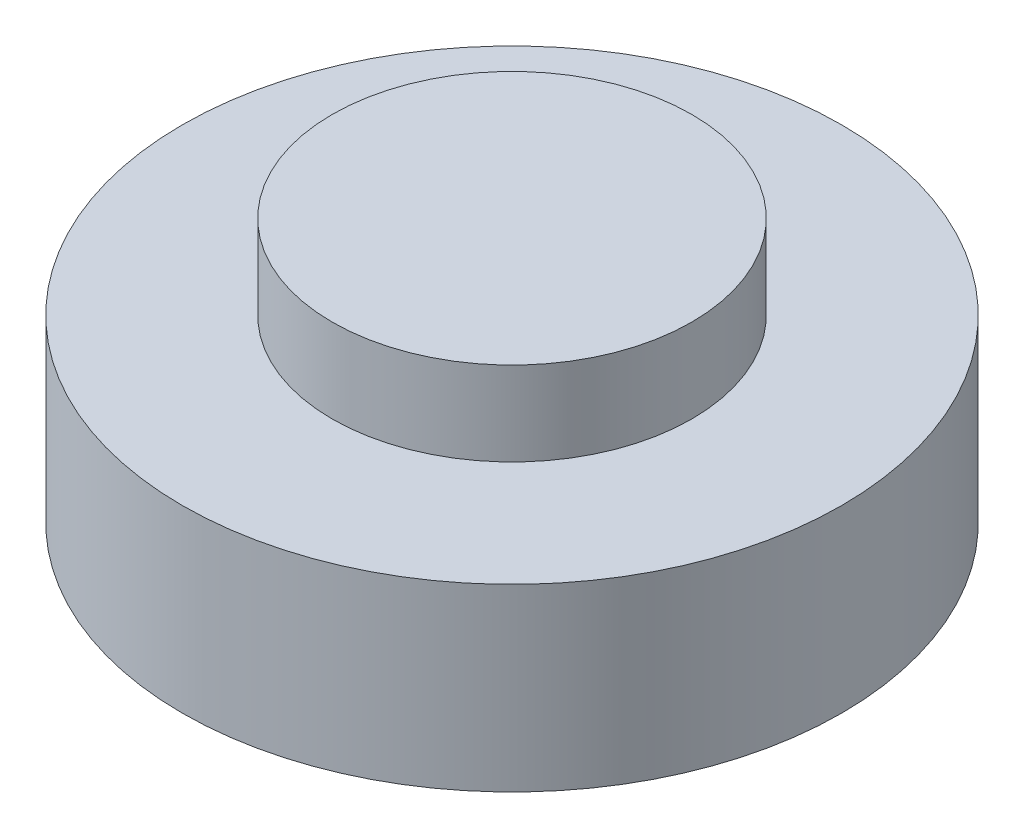
ISO-10303-21;
HEADER;
FILE_DESCRIPTION(('STEP AP214'),'2;1');
FILE_NAME('part.step','',(''),(''),'','','');
FILE_SCHEMA(('AUTOMOTIVE_DESIGN { 1 0 10303 214 1 1 1 1 }'));
ENDSEC;
DATA;
#1=APPLICATION_CONTEXT('core data for automotive mechanical design processes');
#2=APPLICATION_PROTOCOL_DEFINITION('international standard','automotive_design',2000,#1);
#3=PRODUCT_CONTEXT('',#1,'mechanical');
#4=PRODUCT('Part','Part','',(#3));
#5=PRODUCT_RELATED_PRODUCT_CATEGORY('part','',(#4));
#6=PRODUCT_DEFINITION_FORMATION('','',#4);
#7=PRODUCT_DEFINITION_CONTEXT('part definition',#1,'design');
#8=PRODUCT_DEFINITION('design','',#6,#7);
#9=PRODUCT_DEFINITION_SHAPE('','',#8);
#10=(LENGTH_UNIT() NAMED_UNIT(*) SI_UNIT(.MILLI.,.METRE.));
#11=(NAMED_UNIT(*) PLANE_ANGLE_UNIT() SI_UNIT($,.RADIAN.));
#12=(NAMED_UNIT(*) SI_UNIT($,.STERADIAN.) SOLID_ANGLE_UNIT());
#13=UNCERTAINTY_MEASURE_WITH_UNIT(LENGTH_MEASURE(1.E-05),#10,'distance_accuracy_value','');
#14=(GEOMETRIC_REPRESENTATION_CONTEXT(3) GLOBAL_UNCERTAINTY_ASSIGNED_CONTEXT((#13)) GLOBAL_UNIT_ASSIGNED_CONTEXT((#10,
#11,#12)) REPRESENTATION_CONTEXT('',''));
#15=CARTESIAN_POINT('',(0.,0.,0.));
#16=DIRECTION('',(0.,0.,1.));
#17=DIRECTION('',(1.,0.,0.));
#18=AXIS2_PLACEMENT_3D('',#15,#16,#17);
#19=CARTESIAN_POINT('',(0.,15.,0.));
#20=DIRECTION('',(0.,-1.,0.));
#21=DIRECTION('',(0.,0.,-1.));
#22=AXIS2_PLACEMENT_3D('',#19,#20,#21);
#23=CYLINDRICAL_SURFACE('',#22,27.5);
#24=CARTESIAN_POINT('',(0.,15.,0.));
#25=DIRECTION('',(0.,1.,0.));
#26=DIRECTION('',(0.,0.,1.));
#27=AXIS2_PLACEMENT_3D('',#24,#25,#26);
#28=CIRCLE('',#27,27.5);
#29=CARTESIAN_POINT('',(0.,15.,27.5));
#30=VERTEX_POINT('',#29);
#31=EDGE_CURVE('E44',#30,#30,#28,.T.);
#32=ORIENTED_EDGE('',*,*,#31,.F.);
#33=EDGE_LOOP('',(#32));
#34=FACE_BOUND('',#33,.T.);
#35=CARTESIAN_POINT('',(0.,0.,0.));
#36=DIRECTION('',(0.,1.,0.));
#37=DIRECTION('',(0.,0.,1.));
#38=AXIS2_PLACEMENT_3D('',#35,#36,#37);
#39=CIRCLE('',#38,27.5);
#40=CARTESIAN_POINT('',(0.,0.,27.5));
#41=VERTEX_POINT('',#40);
#42=EDGE_CURVE('E40',#41,#41,#39,.T.);
#43=ORIENTED_EDGE('',*,*,#42,.T.);
#44=EDGE_LOOP('',(#43));
#45=FACE_BOUND('',#44,.T.);
#46=ADVANCED_FACE('F37',(#34,#45),#23,.T.);
#47=CARTESIAN_POINT('',(0.,15.,0.));
#48=DIRECTION('',(0.,1.,0.));
#49=DIRECTION('',(0.,0.,1.));
#50=AXIS2_PLACEMENT_3D('',#47,#48,#49);
#51=PLANE('',#50);
#52=CARTESIAN_POINT('',(0.,15.,0.));
#53=DIRECTION('',(0.,1.,0.));
#54=DIRECTION('',(0.,0.,1.));
#55=AXIS2_PLACEMENT_3D('',#52,#53,#54);
#56=CIRCLE('',#55,15.);
#57=CARTESIAN_POINT('',(0.,15.,15.));
#58=VERTEX_POINT('',#57);
#59=EDGE_CURVE('E10',#58,#58,#56,.T.);
#60=ORIENTED_EDGE('',*,*,#59,.F.);
#61=EDGE_LOOP('',(#60));
#62=FACE_BOUND('',#61,.T.);
#63=ORIENTED_EDGE('',*,*,#31,.T.);
#64=EDGE_LOOP('',(#63));
#65=FACE_BOUND('',#64,.T.);
#66=ADVANCED_FACE('F61',(#62,#65),#51,.T.);
#67=CARTESIAN_POINT('',(0.,0.,0.));
#68=DIRECTION('',(0.,1.,0.));
#69=DIRECTION('',(0.,0.,1.));
#70=AXIS2_PLACEMENT_3D('',#67,#68,#69);
#71=PLANE('',#70);
#72=ORIENTED_EDGE('',*,*,#42,.F.);
#73=EDGE_LOOP('',(#72));
#74=FACE_BOUND('',#73,.T.);
#75=ADVANCED_FACE('F58',(#74),#71,.F.);
#76=CARTESIAN_POINT('',(0.,22.,0.));
#77=DIRECTION('',(0.,-1.,0.));
#78=DIRECTION('',(0.,0.,-1.));
#79=AXIS2_PLACEMENT_3D('',#76,#77,#78);
#80=CYLINDRICAL_SURFACE('',#79,15.);
#81=CARTESIAN_POINT('',(0.,22.,0.));
#82=DIRECTION('',(0.,1.,0.));
#83=DIRECTION('',(0.,0.,1.));
#84=AXIS2_PLACEMENT_3D('',#81,#82,#83);
#85=CIRCLE('',#84,15.);
#86=CARTESIAN_POINT('',(0.,22.,15.));
#87=VERTEX_POINT('',#86);
#88=EDGE_CURVE('E50',#87,#87,#85,.T.);
#89=ORIENTED_EDGE('',*,*,#88,.F.);
#90=EDGE_LOOP('',(#89));
#91=FACE_BOUND('',#90,.T.);
#92=ORIENTED_EDGE('',*,*,#59,.T.);
#93=EDGE_LOOP('',(#92));
#94=FACE_BOUND('',#93,.T.);
#95=ADVANCED_FACE('F60',(#91,#94),#80,.T.);
#96=CARTESIAN_POINT('',(0.,22.,0.));
#97=DIRECTION('',(0.,1.,0.));
#98=DIRECTION('',(0.,0.,1.));
#99=AXIS2_PLACEMENT_3D('',#96,#97,#98);
#100=PLANE('',#99);
#101=ORIENTED_EDGE('',*,*,#88,.T.);
#102=EDGE_LOOP('',(#101));
#103=FACE_BOUND('',#102,.T.);
#104=ADVANCED_FACE('F67',(#103),#100,.T.);
#105=CLOSED_SHELL('',(#46,#66,#75,#95,#104));
#106=MANIFOLD_SOLID_BREP('B2',#105);
#107=ADVANCED_BREP_SHAPE_REPRESENTATION('',(#18,#106),#14);
#108=SHAPE_DEFINITION_REPRESENTATION(#9,#107);
ENDSEC;
END-ISO-10303-21;
